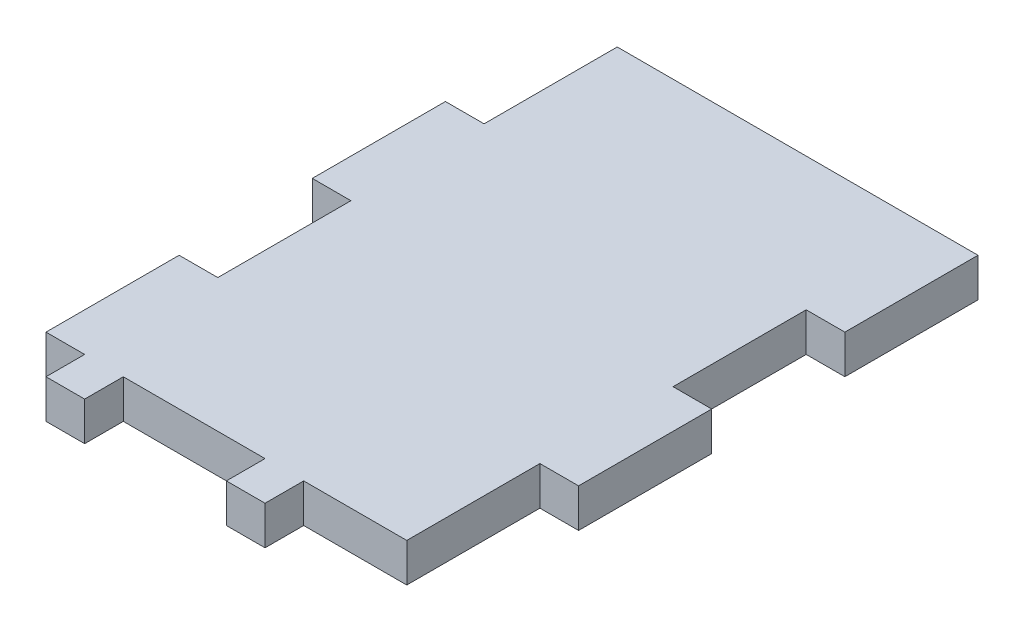
ISO-10303-21;
HEADER;
FILE_DESCRIPTION(('STEP AP214'),'2;1');
FILE_NAME('part.step','',(''),(''),'','','');
FILE_SCHEMA(('AUTOMOTIVE_DESIGN { 1 0 10303 214 1 1 1 1 }'));
ENDSEC;
DATA;
#1=APPLICATION_CONTEXT('core data for automotive mechanical design processes');
#2=APPLICATION_PROTOCOL_DEFINITION('international standard','automotive_design',2000,#1);
#3=PRODUCT_CONTEXT('',#1,'mechanical');
#4=PRODUCT('Part','Part','',(#3));
#5=PRODUCT_RELATED_PRODUCT_CATEGORY('part','',(#4));
#6=PRODUCT_DEFINITION_FORMATION('','',#4);
#7=PRODUCT_DEFINITION_CONTEXT('part definition',#1,'design');
#8=PRODUCT_DEFINITION('design','',#6,#7);
#9=PRODUCT_DEFINITION_SHAPE('','',#8);
#10=(LENGTH_UNIT() NAMED_UNIT(*) SI_UNIT(.MILLI.,.METRE.));
#11=(NAMED_UNIT(*) PLANE_ANGLE_UNIT() SI_UNIT($,.RADIAN.));
#12=(NAMED_UNIT(*) SI_UNIT($,.STERADIAN.) SOLID_ANGLE_UNIT());
#13=UNCERTAINTY_MEASURE_WITH_UNIT(LENGTH_MEASURE(1.E-05),#10,'distance_accuracy_value','');
#14=(GEOMETRIC_REPRESENTATION_CONTEXT(3) GLOBAL_UNCERTAINTY_ASSIGNED_CONTEXT((#13)) GLOBAL_UNIT_ASSIGNED_CONTEXT((#10,
#11,#12)) REPRESENTATION_CONTEXT('',''));
#15=CARTESIAN_POINT('',(0.,0.,0.));
#16=DIRECTION('',(0.,0.,1.));
#17=DIRECTION('',(1.,0.,0.));
#18=AXIS2_PLACEMENT_3D('',#15,#16,#17);
#19=CARTESIAN_POINT('',(-21.,4.5,-31.0000000000017));
#20=DIRECTION('',(1.,0.,0.));
#21=DIRECTION('',(0.,0.,-1.));
#22=AXIS2_PLACEMENT_3D('',#19,#20,#21);
#23=PLANE('',#22);
#24=DIRECTION('',(0.,0.,1.));
#25=VECTOR('',#24,1.);
#26=CARTESIAN_POINT('',(-21.,0.,-31.0000000000017));
#27=LINE('',#26,#25);
#28=CARTESIAN_POINT('',(-21.,0.,-31.0000000000017));
#29=VERTEX_POINT('',#28);
#30=CARTESIAN_POINT('',(-21.0000000000001,0.,-15.5000000000008));
#31=VERTEX_POINT('',#30);
#32=EDGE_CURVE('E224',#29,#31,#27,.T.);
#33=ORIENTED_EDGE('',*,*,#32,.T.);
#34=DIRECTION('',(0.,-1.,0.));
#35=VECTOR('',#34,1.);
#36=CARTESIAN_POINT('',(-21.0000000000001,4.5,-15.5000000000008));
#37=LINE('',#36,#35);
#38=CARTESIAN_POINT('',(-21.0000000000001,4.5,-15.5000000000008));
#39=VERTEX_POINT('',#38);
#40=EDGE_CURVE('E11',#39,#31,#37,.T.);
#41=ORIENTED_EDGE('',*,*,#40,.F.);
#42=DIRECTION('',(0.,0.,1.));
#43=VECTOR('',#42,1.);
#44=CARTESIAN_POINT('',(-21.,4.5,-31.0000000000017));
#45=LINE('',#44,#43);
#46=CARTESIAN_POINT('',(-21.,4.5,-31.0000000000017));
#47=VERTEX_POINT('',#46);
#48=EDGE_CURVE('E270',#47,#39,#45,.T.);
#49=ORIENTED_EDGE('',*,*,#48,.F.);
#50=DIRECTION('',(0.,-1.,0.));
#51=VECTOR('',#50,1.);
#52=CARTESIAN_POINT('',(-21.,4.5,-31.0000000000017));
#53=LINE('',#52,#51);
#54=EDGE_CURVE('E220',#47,#29,#53,.T.);
#55=ORIENTED_EDGE('',*,*,#54,.T.);
#56=EDGE_LOOP('',(#33,#41,#49,#55));
#57=FACE_BOUND('',#56,.T.);
#58=ADVANCED_FACE('F32',(#57),#23,.F.);
#59=CARTESIAN_POINT('',(-25.5000000000001,4.5,-15.5000000000008));
#60=DIRECTION('',(0.,0.,1.));
#61=DIRECTION('',(1.,0.,0.));
#62=AXIS2_PLACEMENT_3D('',#59,#60,#61);
#63=PLANE('',#62);
#64=DIRECTION('',(-1.,0.,0.));
#65=VECTOR('',#64,1.);
#66=CARTESIAN_POINT('',(-25.5000000000001,0.,-15.5000000000008));
#67=LINE('',#66,#65);
#68=CARTESIAN_POINT('',(-25.5000000000001,0.,-15.5000000000008));
#69=VERTEX_POINT('',#68);
#70=EDGE_CURVE('E227',#31,#69,#67,.T.);
#71=ORIENTED_EDGE('',*,*,#70,.T.);
#72=DIRECTION('',(0.,-1.,0.));
#73=VECTOR('',#72,1.);
#74=CARTESIAN_POINT('',(-25.5000000000001,4.5,-15.5000000000008));
#75=LINE('',#74,#73);
#76=CARTESIAN_POINT('',(-25.5000000000001,4.5,-15.5000000000008));
#77=VERTEX_POINT('',#76);
#78=EDGE_CURVE('E40',#77,#69,#75,.T.);
#79=ORIENTED_EDGE('',*,*,#78,.F.);
#80=DIRECTION('',(-1.,0.,0.));
#81=VECTOR('',#80,1.);
#82=CARTESIAN_POINT('',(-25.5000000000001,4.5,-15.5000000000008));
#83=LINE('',#82,#81);
#84=EDGE_CURVE('E139',#39,#77,#83,.T.);
#85=ORIENTED_EDGE('',*,*,#84,.F.);
#86=ORIENTED_EDGE('',*,*,#40,.T.);
#87=EDGE_LOOP('',(#71,#79,#85,#86));
#88=FACE_BOUND('',#87,.T.);
#89=ADVANCED_FACE('F408',(#88),#63,.F.);
#90=CARTESIAN_POINT('',(-25.5000000000001,4.5,-15.5000000000008));
#91=DIRECTION('',(1.,0.,0.));
#92=DIRECTION('',(0.,0.,-1.));
#93=AXIS2_PLACEMENT_3D('',#90,#91,#92);
#94=PLANE('',#93);
#95=DIRECTION('',(0.,0.,1.));
#96=VECTOR('',#95,1.);
#97=CARTESIAN_POINT('',(-25.5000000000001,0.,-15.5000000000008));
#98=LINE('',#97,#96);
#99=CARTESIAN_POINT('',(-25.5,0.,0.));
#100=VERTEX_POINT('',#99);
#101=EDGE_CURVE('E229',#69,#100,#98,.T.);
#102=ORIENTED_EDGE('',*,*,#101,.T.);
#103=DIRECTION('',(0.,-1.,0.));
#104=VECTOR('',#103,1.);
#105=CARTESIAN_POINT('',(-25.5,4.5,0.));
#106=LINE('',#105,#104);
#107=CARTESIAN_POINT('',(-25.5,4.5,0.));
#108=VERTEX_POINT('',#107);
#109=EDGE_CURVE('E325',#108,#100,#106,.T.);
#110=ORIENTED_EDGE('',*,*,#109,.F.);
#111=DIRECTION('',(0.,0.,1.));
#112=VECTOR('',#111,1.);
#113=CARTESIAN_POINT('',(-25.5000000000001,4.5,-15.5000000000008));
#114=LINE('',#113,#112);
#115=EDGE_CURVE('E333',#77,#108,#114,.T.);
#116=ORIENTED_EDGE('',*,*,#115,.F.);
#117=ORIENTED_EDGE('',*,*,#78,.T.);
#118=EDGE_LOOP('',(#102,#110,#116,#117));
#119=FACE_BOUND('',#118,.T.);
#120=ADVANCED_FACE('F331',(#119),#94,.F.);
#121=CARTESIAN_POINT('',(-25.5,4.5,0.));
#122=DIRECTION('',(0.,0.,-1.));
#123=DIRECTION('',(-1.,0.,0.));
#124=AXIS2_PLACEMENT_3D('',#121,#122,#123);
#125=PLANE('',#124);
#126=DIRECTION('',(1.,0.,0.));
#127=VECTOR('',#126,1.);
#128=CARTESIAN_POINT('',(-25.5,0.,0.));
#129=LINE('',#128,#127);
#130=CARTESIAN_POINT('',(-21.,0.,-2.78106847215906E-13));
#131=VERTEX_POINT('',#130);
#132=EDGE_CURVE('E231',#100,#131,#129,.T.);
#133=ORIENTED_EDGE('',*,*,#132,.T.);
#134=DIRECTION('',(0.,-1.,0.));
#135=VECTOR('',#134,1.);
#136=CARTESIAN_POINT('',(-21.,4.5,-2.78106847215906E-13));
#137=LINE('',#136,#135);
#138=CARTESIAN_POINT('',(-21.,4.5,-2.78106847215906E-13));
#139=VERTEX_POINT('',#138);
#140=EDGE_CURVE('E322',#139,#131,#137,.T.);
#141=ORIENTED_EDGE('',*,*,#140,.F.);
#142=DIRECTION('',(1.,0.,0.));
#143=VECTOR('',#142,1.);
#144=CARTESIAN_POINT('',(-25.5,4.5,0.));
#145=LINE('',#144,#143);
#146=EDGE_CURVE('E351',#108,#139,#145,.T.);
#147=ORIENTED_EDGE('',*,*,#146,.F.);
#148=ORIENTED_EDGE('',*,*,#109,.T.);
#149=EDGE_LOOP('',(#133,#141,#147,#148));
#150=FACE_BOUND('',#149,.T.);
#151=ADVANCED_FACE('F342',(#150),#125,.F.);
#152=CARTESIAN_POINT('',(-21.,4.5,-2.78106847215906E-13));
#153=DIRECTION('',(1.,0.,0.));
#154=DIRECTION('',(0.,0.,-1.));
#155=AXIS2_PLACEMENT_3D('',#152,#153,#154);
#156=PLANE('',#155);
#157=DIRECTION('',(0.,0.,1.));
#158=VECTOR('',#157,1.);
#159=CARTESIAN_POINT('',(-21.,0.,-2.78106847215906E-13));
#160=LINE('',#159,#158);
#161=CARTESIAN_POINT('',(-21.,0.,15.5000000000008));
#162=VERTEX_POINT('',#161);
#163=EDGE_CURVE('E233',#131,#162,#160,.T.);
#164=ORIENTED_EDGE('',*,*,#163,.T.);
#165=DIRECTION('',(0.,-1.,0.));
#166=VECTOR('',#165,1.);
#167=CARTESIAN_POINT('',(-21.,4.5,15.5000000000008));
#168=LINE('',#167,#166);
#169=CARTESIAN_POINT('',(-21.,4.5,15.5000000000008));
#170=VERTEX_POINT('',#169);
#171=EDGE_CURVE('E319',#170,#162,#168,.T.);
#172=ORIENTED_EDGE('',*,*,#171,.F.);
#173=DIRECTION('',(0.,0.,1.));
#174=VECTOR('',#173,1.);
#175=CARTESIAN_POINT('',(-21.,4.5,-2.78106847215906E-13));
#176=LINE('',#175,#174);
#177=EDGE_CURVE('E348',#139,#170,#176,.T.);
#178=ORIENTED_EDGE('',*,*,#177,.F.);
#179=ORIENTED_EDGE('',*,*,#140,.T.);
#180=EDGE_LOOP('',(#164,#172,#178,#179));
#181=FACE_BOUND('',#180,.T.);
#182=ADVANCED_FACE('F346',(#181),#156,.F.);
#183=CARTESIAN_POINT('',(-21.,4.5,15.5000000000008));
#184=DIRECTION('',(0.,0.,1.));
#185=DIRECTION('',(1.,0.,0.));
#186=AXIS2_PLACEMENT_3D('',#183,#184,#185);
#187=PLANE('',#186);
#188=DIRECTION('',(-1.,0.,0.));
#189=VECTOR('',#188,1.);
#190=CARTESIAN_POINT('',(-21.,0.,15.5000000000008));
#191=LINE('',#190,#189);
#192=CARTESIAN_POINT('',(-25.5,0.,15.5000000000008));
#193=VERTEX_POINT('',#192);
#194=EDGE_CURVE('E235',#162,#193,#191,.T.);
#195=ORIENTED_EDGE('',*,*,#194,.T.);
#196=DIRECTION('',(0.,-1.,0.));
#197=VECTOR('',#196,1.);
#198=CARTESIAN_POINT('',(-25.5,4.5,15.5000000000008));
#199=LINE('',#198,#197);
#200=CARTESIAN_POINT('',(-25.5,4.5,15.5000000000008));
#201=VERTEX_POINT('',#200);
#202=EDGE_CURVE('E316',#201,#193,#199,.T.);
#203=ORIENTED_EDGE('',*,*,#202,.F.);
#204=DIRECTION('',(-1.,0.,0.));
#205=VECTOR('',#204,1.);
#206=CARTESIAN_POINT('',(-21.,4.5,15.5000000000008));
#207=LINE('',#206,#205);
#208=EDGE_CURVE('E350',#170,#201,#207,.T.);
#209=ORIENTED_EDGE('',*,*,#208,.F.);
#210=ORIENTED_EDGE('',*,*,#171,.T.);
#211=EDGE_LOOP('',(#195,#203,#209,#210));
#212=FACE_BOUND('',#211,.T.);
#213=ADVANCED_FACE('F421',(#212),#187,.F.);
#214=CARTESIAN_POINT('',(-25.5,4.5,15.5000000000008));
#215=DIRECTION('',(1.,0.,0.));
#216=DIRECTION('',(0.,0.,-1.));
#217=AXIS2_PLACEMENT_3D('',#214,#215,#216);
#218=PLANE('',#217);
#219=DIRECTION('',(0.,0.,1.));
#220=VECTOR('',#219,1.);
#221=CARTESIAN_POINT('',(-25.5,0.,15.5000000000008));
#222=LINE('',#221,#220);
#223=CARTESIAN_POINT('',(-25.5,0.,31.0000000000017));
#224=VERTEX_POINT('',#223);
#225=EDGE_CURVE('E237',#193,#224,#222,.T.);
#226=ORIENTED_EDGE('',*,*,#225,.T.);
#227=DIRECTION('',(0.,-1.,0.));
#228=VECTOR('',#227,1.);
#229=CARTESIAN_POINT('',(-25.5,4.5,31.0000000000017));
#230=LINE('',#229,#228);
#231=CARTESIAN_POINT('',(-25.5,4.5,31.0000000000017));
#232=VERTEX_POINT('',#231);
#233=EDGE_CURVE('E313',#232,#224,#230,.T.);
#234=ORIENTED_EDGE('',*,*,#233,.F.);
#235=DIRECTION('',(0.,0.,1.));
#236=VECTOR('',#235,1.);
#237=CARTESIAN_POINT('',(-25.5,4.5,15.5000000000008));
#238=LINE('',#237,#236);
#239=EDGE_CURVE('E353',#201,#232,#238,.T.);
#240=ORIENTED_EDGE('',*,*,#239,.F.);
#241=ORIENTED_EDGE('',*,*,#202,.T.);
#242=EDGE_LOOP('',(#226,#234,#240,#241));
#243=FACE_BOUND('',#242,.T.);
#244=ADVANCED_FACE('F424',(#243),#218,.F.);
#245=CARTESIAN_POINT('',(-21.,4.5,31.0000000000017));
#246=DIRECTION('',(0.,0.,-1.));
#247=DIRECTION('',(-1.,0.,0.));
#248=AXIS2_PLACEMENT_3D('',#245,#246,#247);
#249=PLANE('',#248);
#250=DIRECTION('',(1.,0.,0.));
#251=VECTOR('',#250,1.);
#252=CARTESIAN_POINT('',(-21.,0.,31.0000000000017));
#253=LINE('',#252,#251);
#254=CARTESIAN_POINT('',(-21.,0.,31.0000000000017));
#255=VERTEX_POINT('',#254);
#256=EDGE_CURVE('E239',#224,#255,#253,.T.);
#257=ORIENTED_EDGE('',*,*,#256,.T.);
#258=DIRECTION('',(0.,-1.,0.));
#259=VECTOR('',#258,1.);
#260=CARTESIAN_POINT('',(-21.,4.5,31.0000000000017));
#261=LINE('',#260,#259);
#262=CARTESIAN_POINT('',(-21.,4.5,31.0000000000017));
#263=VERTEX_POINT('',#262);
#264=EDGE_CURVE('E310',#263,#255,#261,.T.);
#265=ORIENTED_EDGE('',*,*,#264,.F.);
#266=DIRECTION('',(1.,0.,0.));
#267=VECTOR('',#266,1.);
#268=CARTESIAN_POINT('',(-21.,4.5,31.0000000000017));
#269=LINE('',#268,#267);
#270=EDGE_CURVE('E359',#232,#263,#269,.T.);
#271=ORIENTED_EDGE('',*,*,#270,.F.);
#272=ORIENTED_EDGE('',*,*,#233,.T.);
#273=EDGE_LOOP('',(#257,#265,#271,#272));
#274=FACE_BOUND('',#273,.T.);
#275=ADVANCED_FACE('F428',(#274),#249,.F.);
#276=CARTESIAN_POINT('',(-21.,4.5,31.0000000000017));
#277=DIRECTION('',(1.,0.,0.));
#278=DIRECTION('',(0.,0.,-1.));
#279=AXIS2_PLACEMENT_3D('',#276,#277,#278);
#280=PLANE('',#279);
#281=DIRECTION('',(0.,0.,1.));
#282=VECTOR('',#281,1.);
#283=CARTESIAN_POINT('',(-21.,0.,31.0000000000017));
#284=LINE('',#283,#282);
#285=CARTESIAN_POINT('',(-21.,0.,35.5000000000017));
#286=VERTEX_POINT('',#285);
#287=EDGE_CURVE('E241',#255,#286,#284,.T.);
#288=ORIENTED_EDGE('',*,*,#287,.T.);
#289=DIRECTION('',(0.,-1.,0.));
#290=VECTOR('',#289,1.);
#291=CARTESIAN_POINT('',(-21.,4.5,35.5000000000017));
#292=LINE('',#291,#290);
#293=CARTESIAN_POINT('',(-21.,4.5,35.5000000000017));
#294=VERTEX_POINT('',#293);
#295=EDGE_CURVE('E307',#294,#286,#292,.T.);
#296=ORIENTED_EDGE('',*,*,#295,.F.);
#297=DIRECTION('',(0.,0.,1.));
#298=VECTOR('',#297,1.);
#299=CARTESIAN_POINT('',(-21.,4.5,31.0000000000017));
#300=LINE('',#299,#298);
#301=EDGE_CURVE('E361',#263,#294,#300,.T.);
#302=ORIENTED_EDGE('',*,*,#301,.F.);
#303=ORIENTED_EDGE('',*,*,#264,.T.);
#304=EDGE_LOOP('',(#288,#296,#302,#303));
#305=FACE_BOUND('',#304,.T.);
#306=ADVANCED_FACE('F432',(#305),#280,.F.);
#307=CARTESIAN_POINT('',(-21.,4.5,35.5000000000017));
#308=DIRECTION('',(0.,0.,-1.));
#309=DIRECTION('',(-1.,0.,0.));
#310=AXIS2_PLACEMENT_3D('',#307,#308,#309);
#311=PLANE('',#310);
#312=DIRECTION('',(1.,0.,0.));
#313=VECTOR('',#312,1.);
#314=CARTESIAN_POINT('',(-21.,0.,35.5000000000017));
#315=LINE('',#314,#313);
#316=CARTESIAN_POINT('',(-16.5,0.,35.5000000000017));
#317=VERTEX_POINT('',#316);
#318=EDGE_CURVE('E243',#286,#317,#315,.T.);
#319=ORIENTED_EDGE('',*,*,#318,.T.);
#320=DIRECTION('',(0.,-1.,0.));
#321=VECTOR('',#320,1.);
#322=CARTESIAN_POINT('',(-16.5,4.5,35.5000000000017));
#323=LINE('',#322,#321);
#324=CARTESIAN_POINT('',(-16.5,4.5,35.5000000000017));
#325=VERTEX_POINT('',#324);
#326=EDGE_CURVE('E304',#325,#317,#323,.T.);
#327=ORIENTED_EDGE('',*,*,#326,.F.);
#328=DIRECTION('',(1.,0.,0.));
#329=VECTOR('',#328,1.);
#330=CARTESIAN_POINT('',(-21.,4.5,35.5000000000017));
#331=LINE('',#330,#329);
#332=EDGE_CURVE('E363',#294,#325,#331,.T.);
#333=ORIENTED_EDGE('',*,*,#332,.F.);
#334=ORIENTED_EDGE('',*,*,#295,.T.);
#335=EDGE_LOOP('',(#319,#327,#333,#334));
#336=FACE_BOUND('',#335,.T.);
#337=ADVANCED_FACE('F436',(#336),#311,.F.);
#338=CARTESIAN_POINT('',(-16.5,4.5,35.5000000000017));
#339=DIRECTION('',(-1.,0.,0.));
#340=DIRECTION('',(0.,0.,1.));
#341=AXIS2_PLACEMENT_3D('',#338,#339,#340);
#342=PLANE('',#341);
#343=DIRECTION('',(0.,0.,-1.));
#344=VECTOR('',#343,1.);
#345=CARTESIAN_POINT('',(-16.5,0.,35.5000000000017));
#346=LINE('',#345,#344);
#347=CARTESIAN_POINT('',(-16.5,0.,31.0000000000017));
#348=VERTEX_POINT('',#347);
#349=EDGE_CURVE('E245',#317,#348,#346,.T.);
#350=ORIENTED_EDGE('',*,*,#349,.T.);
#351=DIRECTION('',(0.,-1.,0.));
#352=VECTOR('',#351,1.);
#353=CARTESIAN_POINT('',(-16.5,4.5,31.0000000000017));
#354=LINE('',#353,#352);
#355=CARTESIAN_POINT('',(-16.5,4.5,31.0000000000017));
#356=VERTEX_POINT('',#355);
#357=EDGE_CURVE('E301',#356,#348,#354,.T.);
#358=ORIENTED_EDGE('',*,*,#357,.F.);
#359=DIRECTION('',(0.,0.,-1.));
#360=VECTOR('',#359,1.);
#361=CARTESIAN_POINT('',(-16.5,4.5,35.5000000000017));
#362=LINE('',#361,#360);
#363=EDGE_CURVE('E365',#325,#356,#362,.T.);
#364=ORIENTED_EDGE('',*,*,#363,.F.);
#365=ORIENTED_EDGE('',*,*,#326,.T.);
#366=EDGE_LOOP('',(#350,#358,#364,#365));
#367=FACE_BOUND('',#366,.T.);
#368=ADVANCED_FACE('F440',(#367),#342,.F.);
#369=CARTESIAN_POINT('',(-16.5,4.5,31.0000000000017));
#370=DIRECTION('',(0.,0.,-1.));
#371=DIRECTION('',(-1.,0.,0.));
#372=AXIS2_PLACEMENT_3D('',#369,#370,#371);
#373=PLANE('',#372);
#374=DIRECTION('',(1.,0.,0.));
#375=VECTOR('',#374,1.);
#376=CARTESIAN_POINT('',(-16.5,0.,31.0000000000017));
#377=LINE('',#376,#375);
#378=CARTESIAN_POINT('',(0.,0.,31.0000000000017));
#379=VERTEX_POINT('',#378);
#380=EDGE_CURVE('E247',#348,#379,#377,.T.);
#381=ORIENTED_EDGE('',*,*,#380,.T.);
#382=DIRECTION('',(0.,-1.,0.));
#383=VECTOR('',#382,1.);
#384=CARTESIAN_POINT('',(0.,4.5,31.0000000000017));
#385=LINE('',#384,#383);
#386=CARTESIAN_POINT('',(0.,4.5,31.0000000000017));
#387=VERTEX_POINT('',#386);
#388=EDGE_CURVE('E298',#387,#379,#385,.T.);
#389=ORIENTED_EDGE('',*,*,#388,.F.);
#390=DIRECTION('',(1.,0.,0.));
#391=VECTOR('',#390,1.);
#392=CARTESIAN_POINT('',(-16.5,4.5,31.0000000000017));
#393=LINE('',#392,#391);
#394=EDGE_CURVE('E367',#356,#387,#393,.T.);
#395=ORIENTED_EDGE('',*,*,#394,.F.);
#396=ORIENTED_EDGE('',*,*,#357,.T.);
#397=EDGE_LOOP('',(#381,#389,#395,#396));
#398=FACE_BOUND('',#397,.T.);
#399=ADVANCED_FACE('F444',(#398),#373,.F.);
#400=CARTESIAN_POINT('',(0.,4.5,31.0000000000017));
#401=DIRECTION('',(1.,0.,0.));
#402=DIRECTION('',(0.,0.,-1.));
#403=AXIS2_PLACEMENT_3D('',#400,#401,#402);
#404=PLANE('',#403);
#405=DIRECTION('',(0.,0.,1.));
#406=VECTOR('',#405,1.);
#407=CARTESIAN_POINT('',(0.,0.,31.0000000000017));
#408=LINE('',#407,#406);
#409=CARTESIAN_POINT('',(0.,0.,35.5000000000017));
#410=VERTEX_POINT('',#409);
#411=EDGE_CURVE('E249',#379,#410,#408,.T.);
#412=ORIENTED_EDGE('',*,*,#411,.T.);
#413=DIRECTION('',(0.,-1.,0.));
#414=VECTOR('',#413,1.);
#415=CARTESIAN_POINT('',(0.,4.5,35.5000000000017));
#416=LINE('',#415,#414);
#417=CARTESIAN_POINT('',(0.,4.5,35.5000000000017));
#418=VERTEX_POINT('',#417);
#419=EDGE_CURVE('E295',#418,#410,#416,.T.);
#420=ORIENTED_EDGE('',*,*,#419,.F.);
#421=DIRECTION('',(0.,0.,1.));
#422=VECTOR('',#421,1.);
#423=CARTESIAN_POINT('',(0.,4.5,31.0000000000017));
#424=LINE('',#423,#422);
#425=EDGE_CURVE('E369',#387,#418,#424,.T.);
#426=ORIENTED_EDGE('',*,*,#425,.F.);
#427=ORIENTED_EDGE('',*,*,#388,.T.);
#428=EDGE_LOOP('',(#412,#420,#426,#427));
#429=FACE_BOUND('',#428,.T.);
#430=ADVANCED_FACE('F448',(#429),#404,.F.);
#431=CARTESIAN_POINT('',(0.,4.5,35.5000000000017));
#432=DIRECTION('',(0.,0.,-1.));
#433=DIRECTION('',(-1.,0.,0.));
#434=AXIS2_PLACEMENT_3D('',#431,#432,#433);
#435=PLANE('',#434);
#436=DIRECTION('',(1.,0.,0.));
#437=VECTOR('',#436,1.);
#438=CARTESIAN_POINT('',(0.,0.,35.5000000000017));
#439=LINE('',#438,#437);
#440=CARTESIAN_POINT('',(4.5,0.,35.5000000000017));
#441=VERTEX_POINT('',#440);
#442=EDGE_CURVE('E251',#410,#441,#439,.T.);
#443=ORIENTED_EDGE('',*,*,#442,.T.);
#444=DIRECTION('',(0.,-1.,0.));
#445=VECTOR('',#444,1.);
#446=CARTESIAN_POINT('',(4.5,4.5,35.5000000000017));
#447=LINE('',#446,#445);
#448=CARTESIAN_POINT('',(4.5,4.5,35.5000000000017));
#449=VERTEX_POINT('',#448);
#450=EDGE_CURVE('E292',#449,#441,#447,.T.);
#451=ORIENTED_EDGE('',*,*,#450,.F.);
#452=DIRECTION('',(1.,0.,0.));
#453=VECTOR('',#452,1.);
#454=CARTESIAN_POINT('',(0.,4.5,35.5000000000017));
#455=LINE('',#454,#453);
#456=EDGE_CURVE('E371',#418,#449,#455,.T.);
#457=ORIENTED_EDGE('',*,*,#456,.F.);
#458=ORIENTED_EDGE('',*,*,#419,.T.);
#459=EDGE_LOOP('',(#443,#451,#457,#458));
#460=FACE_BOUND('',#459,.T.);
#461=ADVANCED_FACE('F452',(#460),#435,.F.);
#462=CARTESIAN_POINT('',(4.5,4.5,35.5000000000017));
#463=DIRECTION('',(-1.,0.,0.));
#464=DIRECTION('',(0.,0.,1.));
#465=AXIS2_PLACEMENT_3D('',#462,#463,#464);
#466=PLANE('',#465);
#467=DIRECTION('',(0.,0.,-1.));
#468=VECTOR('',#467,1.);
#469=CARTESIAN_POINT('',(4.5,0.,35.5000000000017));
#470=LINE('',#469,#468);
#471=CARTESIAN_POINT('',(4.5,0.,31.0000000000017));
#472=VERTEX_POINT('',#471);
#473=EDGE_CURVE('E253',#441,#472,#470,.T.);
#474=ORIENTED_EDGE('',*,*,#473,.T.);
#475=DIRECTION('',(0.,-1.,0.));
#476=VECTOR('',#475,1.);
#477=CARTESIAN_POINT('',(4.5,4.5,31.0000000000017));
#478=LINE('',#477,#476);
#479=CARTESIAN_POINT('',(4.5,4.5,31.0000000000017));
#480=VERTEX_POINT('',#479);
#481=EDGE_CURVE('E289',#480,#472,#478,.T.);
#482=ORIENTED_EDGE('',*,*,#481,.F.);
#483=DIRECTION('',(0.,0.,-1.));
#484=VECTOR('',#483,1.);
#485=CARTESIAN_POINT('',(4.5,4.5,35.5000000000017));
#486=LINE('',#485,#484);
#487=EDGE_CURVE('E373',#449,#480,#486,.T.);
#488=ORIENTED_EDGE('',*,*,#487,.F.);
#489=ORIENTED_EDGE('',*,*,#450,.T.);
#490=EDGE_LOOP('',(#474,#482,#488,#489));
#491=FACE_BOUND('',#490,.T.);
#492=ADVANCED_FACE('F456',(#491),#466,.F.);
#493=CARTESIAN_POINT('',(16.4999999999993,4.5,31.0000000000017));
#494=DIRECTION('',(0.,0.,-1.));
#495=DIRECTION('',(-1.,0.,0.));
#496=AXIS2_PLACEMENT_3D('',#493,#494,#495);
#497=PLANE('',#496);
#498=DIRECTION('',(1.,0.,0.));
#499=VECTOR('',#498,1.);
#500=CARTESIAN_POINT('',(16.4999999999993,0.,31.0000000000017));
#501=LINE('',#500,#499);
#502=CARTESIAN_POINT('',(16.4999999999993,0.,31.0000000000017));
#503=VERTEX_POINT('',#502);
#504=EDGE_CURVE('E255',#472,#503,#501,.T.);
#505=ORIENTED_EDGE('',*,*,#504,.T.);
#506=DIRECTION('',(0.,-1.,0.));
#507=VECTOR('',#506,1.);
#508=CARTESIAN_POINT('',(16.4999999999993,4.5,31.0000000000017));
#509=LINE('',#508,#507);
#510=CARTESIAN_POINT('',(16.4999999999993,4.5,31.0000000000017));
#511=VERTEX_POINT('',#510);
#512=EDGE_CURVE('E286',#511,#503,#509,.T.);
#513=ORIENTED_EDGE('',*,*,#512,.F.);
#514=DIRECTION('',(1.,0.,0.));
#515=VECTOR('',#514,1.);
#516=CARTESIAN_POINT('',(16.4999999999993,4.5,31.0000000000017));
#517=LINE('',#516,#515);
#518=EDGE_CURVE('E375',#480,#511,#517,.T.);
#519=ORIENTED_EDGE('',*,*,#518,.F.);
#520=ORIENTED_EDGE('',*,*,#481,.T.);
#521=EDGE_LOOP('',(#505,#513,#519,#520));
#522=FACE_BOUND('',#521,.T.);
#523=ADVANCED_FACE('F460',(#522),#497,.F.);
#524=CARTESIAN_POINT('',(16.4999999999993,4.5,31.0000000000017));
#525=DIRECTION('',(-1.,0.,0.));
#526=DIRECTION('',(0.,0.,1.));
#527=AXIS2_PLACEMENT_3D('',#524,#525,#526);
#528=PLANE('',#527);
#529=DIRECTION('',(0.,0.,-1.));
#530=VECTOR('',#529,1.);
#531=CARTESIAN_POINT('',(16.4999999999993,0.,31.0000000000017));
#532=LINE('',#531,#530);
#533=CARTESIAN_POINT('',(16.4999999999993,0.,15.5000000000008));
#534=VERTEX_POINT('',#533);
#535=EDGE_CURVE('E257',#503,#534,#532,.T.);
#536=ORIENTED_EDGE('',*,*,#535,.T.);
#537=DIRECTION('',(0.,-1.,0.));
#538=VECTOR('',#537,1.);
#539=CARTESIAN_POINT('',(16.4999999999993,4.5,15.5000000000008));
#540=LINE('',#539,#538);
#541=CARTESIAN_POINT('',(16.4999999999993,4.5,15.5000000000008));
#542=VERTEX_POINT('',#541);
#543=EDGE_CURVE('E283',#542,#534,#540,.T.);
#544=ORIENTED_EDGE('',*,*,#543,.F.);
#545=DIRECTION('',(0.,0.,-1.));
#546=VECTOR('',#545,1.);
#547=CARTESIAN_POINT('',(16.4999999999993,4.5,31.0000000000017));
#548=LINE('',#547,#546);
#549=EDGE_CURVE('E377',#511,#542,#548,.T.);
#550=ORIENTED_EDGE('',*,*,#549,.F.);
#551=ORIENTED_EDGE('',*,*,#512,.T.);
#552=EDGE_LOOP('',(#536,#544,#550,#551));
#553=FACE_BOUND('',#552,.T.);
#554=ADVANCED_FACE('F464',(#553),#528,.F.);
#555=CARTESIAN_POINT('',(16.4999999999993,4.5,15.5000000000008));
#556=DIRECTION('',(0.,0.,-1.));
#557=DIRECTION('',(-1.,0.,0.));
#558=AXIS2_PLACEMENT_3D('',#555,#556,#557);
#559=PLANE('',#558);
#560=DIRECTION('',(1.,0.,0.));
#561=VECTOR('',#560,1.);
#562=CARTESIAN_POINT('',(16.4999999999993,0.,15.5000000000008));
#563=LINE('',#562,#561);
#564=CARTESIAN_POINT('',(21.,0.,15.5000000000008));
#565=VERTEX_POINT('',#564);
#566=EDGE_CURVE('E259',#534,#565,#563,.T.);
#567=ORIENTED_EDGE('',*,*,#566,.T.);
#568=DIRECTION('',(0.,-1.,0.));
#569=VECTOR('',#568,1.);
#570=CARTESIAN_POINT('',(21.,4.5,15.5000000000008));
#571=LINE('',#570,#569);
#572=CARTESIAN_POINT('',(21.,4.5,15.5000000000008));
#573=VERTEX_POINT('',#572);
#574=EDGE_CURVE('E280',#573,#565,#571,.T.);
#575=ORIENTED_EDGE('',*,*,#574,.F.);
#576=DIRECTION('',(1.,0.,0.));
#577=VECTOR('',#576,1.);
#578=CARTESIAN_POINT('',(16.4999999999993,4.5,15.5000000000008));
#579=LINE('',#578,#577);
#580=EDGE_CURVE('E379',#542,#573,#579,.T.);
#581=ORIENTED_EDGE('',*,*,#580,.F.);
#582=ORIENTED_EDGE('',*,*,#543,.T.);
#583=EDGE_LOOP('',(#567,#575,#581,#582));
#584=FACE_BOUND('',#583,.T.);
#585=ADVANCED_FACE('F468',(#584),#559,.F.);
#586=CARTESIAN_POINT('',(21.,4.5,15.5000000000008));
#587=DIRECTION('',(-1.,0.,0.));
#588=DIRECTION('',(0.,0.,1.));
#589=AXIS2_PLACEMENT_3D('',#586,#587,#588);
#590=PLANE('',#589);
#591=DIRECTION('',(0.,0.,-1.));
#592=VECTOR('',#591,1.);
#593=CARTESIAN_POINT('',(21.,0.,15.5000000000008));
#594=LINE('',#593,#592);
#595=CARTESIAN_POINT('',(21.,0.,0.));
#596=VERTEX_POINT('',#595);
#597=EDGE_CURVE('E261',#565,#596,#594,.T.);
#598=ORIENTED_EDGE('',*,*,#597,.T.);
#599=DIRECTION('',(0.,-1.,0.));
#600=VECTOR('',#599,1.);
#601=CARTESIAN_POINT('',(21.,4.5,0.));
#602=LINE('',#601,#600);
#603=CARTESIAN_POINT('',(21.,4.5,0.));
#604=VERTEX_POINT('',#603);
#605=EDGE_CURVE('E277',#604,#596,#602,.T.);
#606=ORIENTED_EDGE('',*,*,#605,.F.);
#607=DIRECTION('',(0.,0.,-1.));
#608=VECTOR('',#607,1.);
#609=CARTESIAN_POINT('',(21.,4.5,15.5000000000008));
#610=LINE('',#609,#608);
#611=EDGE_CURVE('E381',#573,#604,#610,.T.);
#612=ORIENTED_EDGE('',*,*,#611,.F.);
#613=ORIENTED_EDGE('',*,*,#574,.T.);
#614=EDGE_LOOP('',(#598,#606,#612,#613));
#615=FACE_BOUND('',#614,.T.);
#616=ADVANCED_FACE('F472',(#615),#590,.F.);
#617=CARTESIAN_POINT('',(16.4999999999993,4.5,0.));
#618=DIRECTION('',(0.,0.,1.));
#619=DIRECTION('',(1.,0.,0.));
#620=AXIS2_PLACEMENT_3D('',#617,#618,#619);
#621=PLANE('',#620);
#622=DIRECTION('',(-1.,0.,0.));
#623=VECTOR('',#622,1.);
#624=CARTESIAN_POINT('',(16.4999999999993,0.,0.));
#625=LINE('',#624,#623);
#626=CARTESIAN_POINT('',(16.4999999999993,0.,0.));
#627=VERTEX_POINT('',#626);
#628=EDGE_CURVE('E263',#596,#627,#625,.T.);
#629=ORIENTED_EDGE('',*,*,#628,.T.);
#630=DIRECTION('',(0.,-1.,0.));
#631=VECTOR('',#630,1.);
#632=CARTESIAN_POINT('',(16.4999999999993,4.5,0.));
#633=LINE('',#632,#631);
#634=CARTESIAN_POINT('',(16.4999999999993,4.5,0.));
#635=VERTEX_POINT('',#634);
#636=EDGE_CURVE('E274',#635,#627,#633,.T.);
#637=ORIENTED_EDGE('',*,*,#636,.F.);
#638=DIRECTION('',(-1.,0.,0.));
#639=VECTOR('',#638,1.);
#640=CARTESIAN_POINT('',(16.4999999999993,4.5,0.));
#641=LINE('',#640,#639);
#642=EDGE_CURVE('E383',#604,#635,#641,.T.);
#643=ORIENTED_EDGE('',*,*,#642,.F.);
#644=ORIENTED_EDGE('',*,*,#605,.T.);
#645=EDGE_LOOP('',(#629,#637,#643,#644));
#646=FACE_BOUND('',#645,.T.);
#647=ADVANCED_FACE('F389',(#646),#621,.F.);
#648=CARTESIAN_POINT('',(16.4999999999993,4.5,0.));
#649=DIRECTION('',(-1.,0.,0.));
#650=DIRECTION('',(0.,0.,1.));
#651=AXIS2_PLACEMENT_3D('',#648,#649,#650);
#652=PLANE('',#651);
#653=DIRECTION('',(0.,0.,-1.));
#654=VECTOR('',#653,1.);
#655=CARTESIAN_POINT('',(16.4999999999993,0.,0.));
#656=LINE('',#655,#654);
#657=CARTESIAN_POINT('',(16.4999999999993,0.,-15.5000000000008));
#658=VERTEX_POINT('',#657);
#659=EDGE_CURVE('E265',#627,#658,#656,.T.);
#660=ORIENTED_EDGE('',*,*,#659,.T.);
#661=DIRECTION('',(0.,-1.,0.));
#662=VECTOR('',#661,1.);
#663=CARTESIAN_POINT('',(16.4999999999993,4.5,-15.5000000000008));
#664=LINE('',#663,#662);
#665=CARTESIAN_POINT('',(16.4999999999993,4.5,-15.5000000000008));
#666=VERTEX_POINT('',#665);
#667=EDGE_CURVE('E215',#666,#658,#664,.T.);
#668=ORIENTED_EDGE('',*,*,#667,.F.);
#669=DIRECTION('',(0.,0.,-1.));
#670=VECTOR('',#669,1.);
#671=CARTESIAN_POINT('',(16.4999999999993,4.5,0.));
#672=LINE('',#671,#670);
#673=EDGE_CURVE('E206',#635,#666,#672,.T.);
#674=ORIENTED_EDGE('',*,*,#673,.F.);
#675=ORIENTED_EDGE('',*,*,#636,.T.);
#676=EDGE_LOOP('',(#660,#668,#674,#675));
#677=FACE_BOUND('',#676,.T.);
#678=ADVANCED_FACE('F393',(#677),#652,.F.);
#679=CARTESIAN_POINT('',(16.4999999999993,4.5,-15.5000000000008));
#680=DIRECTION('',(0.,0.,-1.));
#681=DIRECTION('',(-1.,0.,0.));
#682=AXIS2_PLACEMENT_3D('',#679,#680,#681);
#683=PLANE('',#682);
#684=DIRECTION('',(1.,0.,0.));
#685=VECTOR('',#684,1.);
#686=CARTESIAN_POINT('',(16.4999999999993,0.,-15.5000000000008));
#687=LINE('',#686,#685);
#688=CARTESIAN_POINT('',(21.,0.,-15.5000000000008));
#689=VERTEX_POINT('',#688);
#690=EDGE_CURVE('E214',#658,#689,#687,.T.);
#691=ORIENTED_EDGE('',*,*,#690,.T.);
#692=DIRECTION('',(0.,-1.,0.));
#693=VECTOR('',#692,1.);
#694=CARTESIAN_POINT('',(21.,4.5,-15.5000000000008));
#695=LINE('',#694,#693);
#696=CARTESIAN_POINT('',(21.,4.5,-15.5000000000008));
#697=VERTEX_POINT('',#696);
#698=EDGE_CURVE('E211',#697,#689,#695,.T.);
#699=ORIENTED_EDGE('',*,*,#698,.F.);
#700=DIRECTION('',(1.,0.,0.));
#701=VECTOR('',#700,1.);
#702=CARTESIAN_POINT('',(16.4999999999993,4.5,-15.5000000000008));
#703=LINE('',#702,#701);
#704=EDGE_CURVE('E200',#666,#697,#703,.T.);
#705=ORIENTED_EDGE('',*,*,#704,.F.);
#706=ORIENTED_EDGE('',*,*,#667,.T.);
#707=EDGE_LOOP('',(#691,#699,#705,#706));
#708=FACE_BOUND('',#707,.T.);
#709=ADVANCED_FACE('F212',(#708),#683,.F.);
#710=CARTESIAN_POINT('',(21.,4.5,-15.5000000000008));
#711=DIRECTION('',(-1.,0.,0.));
#712=DIRECTION('',(0.,0.,1.));
#713=AXIS2_PLACEMENT_3D('',#710,#711,#712);
#714=PLANE('',#713);
#715=DIRECTION('',(0.,0.,-1.));
#716=VECTOR('',#715,1.);
#717=CARTESIAN_POINT('',(21.,0.,-15.5000000000008));
#718=LINE('',#717,#716);
#719=CARTESIAN_POINT('',(21.,0.,-31.0000000000017));
#720=VERTEX_POINT('',#719);
#721=EDGE_CURVE('E125',#689,#720,#718,.T.);
#722=ORIENTED_EDGE('',*,*,#721,.T.);
#723=DIRECTION('',(0.,-1.,0.));
#724=VECTOR('',#723,1.);
#725=CARTESIAN_POINT('',(21.,4.5,-31.0000000000017));
#726=LINE('',#725,#724);
#727=CARTESIAN_POINT('',(21.,4.5,-31.0000000000017));
#728=VERTEX_POINT('',#727);
#729=EDGE_CURVE('E216',#728,#720,#726,.T.);
#730=ORIENTED_EDGE('',*,*,#729,.F.);
#731=DIRECTION('',(0.,0.,-1.));
#732=VECTOR('',#731,1.);
#733=CARTESIAN_POINT('',(21.,4.5,-15.5000000000008));
#734=LINE('',#733,#732);
#735=EDGE_CURVE('E204',#697,#728,#734,.T.);
#736=ORIENTED_EDGE('',*,*,#735,.F.);
#737=ORIENTED_EDGE('',*,*,#698,.T.);
#738=EDGE_LOOP('',(#722,#730,#736,#737));
#739=FACE_BOUND('',#738,.T.);
#740=ADVANCED_FACE('F218',(#739),#714,.F.);
#741=CARTESIAN_POINT('',(-21.,4.5,-31.0000000000017));
#742=DIRECTION('',(0.,0.,1.));
#743=DIRECTION('',(1.,0.,0.));
#744=AXIS2_PLACEMENT_3D('',#741,#742,#743);
#745=PLANE('',#744);
#746=DIRECTION('',(-1.,0.,0.));
#747=VECTOR('',#746,1.);
#748=CARTESIAN_POINT('',(-21.,0.,-31.0000000000017));
#749=LINE('',#748,#747);
#750=EDGE_CURVE('E131',#720,#29,#749,.T.);
#751=ORIENTED_EDGE('',*,*,#750,.T.);
#752=ORIENTED_EDGE('',*,*,#54,.F.);
#753=DIRECTION('',(-1.,0.,0.));
#754=VECTOR('',#753,1.);
#755=CARTESIAN_POINT('',(-21.,4.5,-31.0000000000017));
#756=LINE('',#755,#754);
#757=EDGE_CURVE('E48',#728,#47,#756,.T.);
#758=ORIENTED_EDGE('',*,*,#757,.F.);
#759=ORIENTED_EDGE('',*,*,#729,.T.);
#760=EDGE_LOOP('',(#751,#752,#758,#759));
#761=FACE_BOUND('',#760,.T.);
#762=ADVANCED_FACE('F397',(#761),#745,.F.);
#763=CARTESIAN_POINT('',(0.,4.5,0.));
#764=DIRECTION('',(0.,1.,0.));
#765=DIRECTION('',(0.,0.,1.));
#766=AXIS2_PLACEMENT_3D('',#763,#764,#765);
#767=PLANE('',#766);
#768=ORIENTED_EDGE('',*,*,#48,.T.);
#769=ORIENTED_EDGE('',*,*,#84,.T.);
#770=ORIENTED_EDGE('',*,*,#115,.T.);
#771=ORIENTED_EDGE('',*,*,#146,.T.);
#772=ORIENTED_EDGE('',*,*,#177,.T.);
#773=ORIENTED_EDGE('',*,*,#208,.T.);
#774=ORIENTED_EDGE('',*,*,#239,.T.);
#775=ORIENTED_EDGE('',*,*,#270,.T.);
#776=ORIENTED_EDGE('',*,*,#301,.T.);
#777=ORIENTED_EDGE('',*,*,#332,.T.);
#778=ORIENTED_EDGE('',*,*,#363,.T.);
#779=ORIENTED_EDGE('',*,*,#394,.T.);
#780=ORIENTED_EDGE('',*,*,#425,.T.);
#781=ORIENTED_EDGE('',*,*,#456,.T.);
#782=ORIENTED_EDGE('',*,*,#487,.T.);
#783=ORIENTED_EDGE('',*,*,#518,.T.);
#784=ORIENTED_EDGE('',*,*,#549,.T.);
#785=ORIENTED_EDGE('',*,*,#580,.T.);
#786=ORIENTED_EDGE('',*,*,#611,.T.);
#787=ORIENTED_EDGE('',*,*,#642,.T.);
#788=ORIENTED_EDGE('',*,*,#673,.T.);
#789=ORIENTED_EDGE('',*,*,#704,.T.);
#790=ORIENTED_EDGE('',*,*,#735,.T.);
#791=ORIENTED_EDGE('',*,*,#757,.T.);
#792=EDGE_LOOP('',(#768,#769,#770,#771,#772,#773,#774,#775,#776,#777,#778,#779,#780,#781,#782,
#783,#784,#785,#786,#787,#788,#789,#790,#791));
#793=FACE_BOUND('',#792,.T.);
#794=ADVANCED_FACE('F202',(#793),#767,.T.);
#795=CARTESIAN_POINT('',(0.,0.,0.));
#796=DIRECTION('',(0.,1.,0.));
#797=DIRECTION('',(0.,0.,1.));
#798=AXIS2_PLACEMENT_3D('',#795,#796,#797);
#799=PLANE('',#798);
#800=ORIENTED_EDGE('',*,*,#32,.F.);
#801=ORIENTED_EDGE('',*,*,#750,.F.);
#802=ORIENTED_EDGE('',*,*,#721,.F.);
#803=ORIENTED_EDGE('',*,*,#690,.F.);
#804=ORIENTED_EDGE('',*,*,#659,.F.);
#805=ORIENTED_EDGE('',*,*,#628,.F.);
#806=ORIENTED_EDGE('',*,*,#597,.F.);
#807=ORIENTED_EDGE('',*,*,#566,.F.);
#808=ORIENTED_EDGE('',*,*,#535,.F.);
#809=ORIENTED_EDGE('',*,*,#504,.F.);
#810=ORIENTED_EDGE('',*,*,#473,.F.);
#811=ORIENTED_EDGE('',*,*,#442,.F.);
#812=ORIENTED_EDGE('',*,*,#411,.F.);
#813=ORIENTED_EDGE('',*,*,#380,.F.);
#814=ORIENTED_EDGE('',*,*,#349,.F.);
#815=ORIENTED_EDGE('',*,*,#318,.F.);
#816=ORIENTED_EDGE('',*,*,#287,.F.);
#817=ORIENTED_EDGE('',*,*,#256,.F.);
#818=ORIENTED_EDGE('',*,*,#225,.F.);
#819=ORIENTED_EDGE('',*,*,#194,.F.);
#820=ORIENTED_EDGE('',*,*,#163,.F.);
#821=ORIENTED_EDGE('',*,*,#132,.F.);
#822=ORIENTED_EDGE('',*,*,#101,.F.);
#823=ORIENTED_EDGE('',*,*,#70,.F.);
#824=EDGE_LOOP('',(#800,#801,#802,#803,#804,#805,#806,#807,#808,#809,#810,#811,#812,#813,#814,
#815,#816,#817,#818,#819,#820,#821,#822,#823));
#825=FACE_BOUND('',#824,.T.);
#826=ADVANCED_FACE('F337',(#825),#799,.F.);
#827=CLOSED_SHELL('',(#58,#89,#120,#151,#182,#213,#244,#275,#306,#337,#368,#399,#430,#461,#492,
#523,#554,#585,#616,#647,#678,#709,#740,#762,#794,#826));
#828=MANIFOLD_SOLID_BREP('B2',#827);
#829=ADVANCED_BREP_SHAPE_REPRESENTATION('',(#18,#828),#14);
#830=SHAPE_DEFINITION_REPRESENTATION(#9,#829);
ENDSEC;
END-ISO-10303-21;
